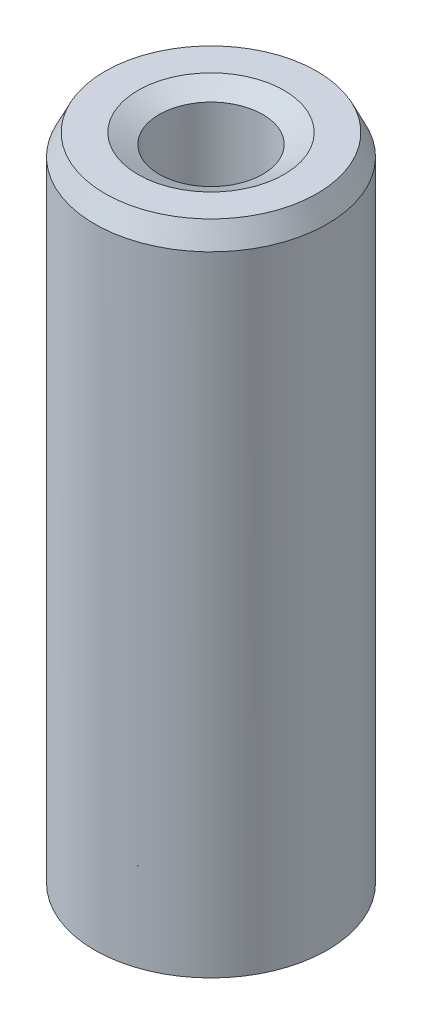
ISO-10303-21;
HEADER;
FILE_DESCRIPTION(('STEP AP214'),'2;1');
FILE_NAME('part.step','',(''),(''),'','','');
FILE_SCHEMA(('AUTOMOTIVE_DESIGN { 1 0 10303 214 1 1 1 1 }'));
ENDSEC;
DATA;
#1=APPLICATION_CONTEXT('core data for automotive mechanical design processes');
#2=APPLICATION_PROTOCOL_DEFINITION('international standard','automotive_design',2000,#1);
#3=PRODUCT_CONTEXT('',#1,'mechanical');
#4=PRODUCT('Part','Part','',(#3));
#5=PRODUCT_RELATED_PRODUCT_CATEGORY('part','',(#4));
#6=PRODUCT_DEFINITION_FORMATION('','',#4);
#7=PRODUCT_DEFINITION_CONTEXT('part definition',#1,'design');
#8=PRODUCT_DEFINITION('design','',#6,#7);
#9=PRODUCT_DEFINITION_SHAPE('','',#8);
#10=(LENGTH_UNIT() NAMED_UNIT(*) SI_UNIT(.MILLI.,.METRE.));
#11=(NAMED_UNIT(*) PLANE_ANGLE_UNIT() SI_UNIT($,.RADIAN.));
#12=(NAMED_UNIT(*) SI_UNIT($,.STERADIAN.) SOLID_ANGLE_UNIT());
#13=UNCERTAINTY_MEASURE_WITH_UNIT(LENGTH_MEASURE(1.E-05),#10,'distance_accuracy_value','');
#14=(GEOMETRIC_REPRESENTATION_CONTEXT(3) GLOBAL_UNCERTAINTY_ASSIGNED_CONTEXT((#13)) GLOBAL_UNIT_ASSIGNED_CONTEXT((#10,
#11,#12)) REPRESENTATION_CONTEXT('',''));
#15=CARTESIAN_POINT('',(0.,0.,0.));
#16=DIRECTION('',(0.,0.,1.));
#17=DIRECTION('',(1.,0.,0.));
#18=AXIS2_PLACEMENT_3D('',#15,#16,#17);
#19=CARTESIAN_POINT('',(0.,28.382326129375,0.));
#20=DIRECTION('',(0.,-1.,0.));
#21=DIRECTION('',(0.,0.,-1.));
#22=AXIS2_PLACEMENT_3D('',#19,#20,#21);
#23=CYLINDRICAL_SURFACE('',#22,5.);
#24=CARTESIAN_POINT('',(0.,0.444401364378996,0.));
#25=DIRECTION('',(0.,1.,0.));
#26=DIRECTION('',(0.,0.,1.));
#27=AXIS2_PLACEMENT_3D('',#24,#25,#26);
#28=CIRCLE('',#27,5.);
#29=CARTESIAN_POINT('',(0.,0.444401364378996,5.));
#30=VERTEX_POINT('',#29);
#31=EDGE_CURVE('E10',#30,#30,#28,.T.);
#32=ORIENTED_EDGE('',*,*,#31,.T.);
#33=EDGE_LOOP('',(#32));
#34=FACE_BOUND('',#33,.T.);
#35=CARTESIAN_POINT('',(0.,27.4717392956713,0.));
#36=DIRECTION('',(0.,1.,0.));
#37=DIRECTION('',(0.,0.,1.));
#38=AXIS2_PLACEMENT_3D('',#35,#36,#37);
#39=CIRCLE('',#38,5.);
#40=CARTESIAN_POINT('',(0.,27.4717392956713,-5.));
#41=VERTEX_POINT('',#40);
#42=EDGE_CURVE('E50',#41,#41,#39,.F.);
#43=ORIENTED_EDGE('',*,*,#42,.T.);
#44=EDGE_LOOP('',(#43));
#45=FACE_BOUND('',#44,.T.);
#46=ADVANCED_FACE('F39',(#34,#45),#23,.T.);
#47=CARTESIAN_POINT('',(0.,28.382326129375,0.));
#48=DIRECTION('',(0.,1.,0.));
#49=DIRECTION('',(0.,0.,1.));
#50=AXIS2_PLACEMENT_3D('',#47,#48,#49);
#51=PLANE('',#50);
#52=CARTESIAN_POINT('',(0.,28.382326129375,0.));
#53=DIRECTION('',(0.,1.,0.));
#54=DIRECTION('',(0.,0.,1.));
#55=AXIS2_PLACEMENT_3D('',#52,#53,#54);
#56=CIRCLE('',#55,3.1370231463045);
#57=CARTESIAN_POINT('',(0.,28.382326129375,3.1370231463045));
#58=VERTEX_POINT('',#57);
#59=EDGE_CURVE('E58',#58,#58,#56,.F.);
#60=ORIENTED_EDGE('',*,*,#59,.T.);
#61=EDGE_LOOP('',(#60));
#62=FACE_BOUND('',#61,.T.);
#63=CARTESIAN_POINT('',(0.,28.382326129375,0.));
#64=DIRECTION('',(0.,1.,0.));
#65=DIRECTION('',(0.,0.,1.));
#66=AXIS2_PLACEMENT_3D('',#63,#64,#65);
#67=CIRCLE('',#66,4.555598635621);
#68=CARTESIAN_POINT('',(0.,28.382326129375,-4.555598635621));
#69=VERTEX_POINT('',#68);
#70=EDGE_CURVE('E61',#69,#69,#67,.T.);
#71=ORIENTED_EDGE('',*,*,#70,.T.);
#72=EDGE_LOOP('',(#71));
#73=FACE_BOUND('',#72,.T.);
#74=ADVANCED_FACE('F88',(#62,#73),#51,.T.);
#75=CARTESIAN_POINT('',(0.,0.,0.));
#76=DIRECTION('',(0.,1.,0.));
#77=DIRECTION('',(0.,0.,1.));
#78=AXIS2_PLACEMENT_3D('',#75,#76,#77);
#79=PLANE('',#78);
#80=CARTESIAN_POINT('',(0.,0.,0.));
#81=DIRECTION('',(0.,1.,0.));
#82=DIRECTION('',(0.,0.,1.));
#83=AXIS2_PLACEMENT_3D('',#80,#81,#82);
#84=CIRCLE('',#83,2.67083767697979);
#85=CARTESIAN_POINT('',(0.,0.,-2.67083767697979));
#86=VERTEX_POINT('',#85);
#87=EDGE_CURVE('E51',#86,#86,#84,.T.);
#88=ORIENTED_EDGE('',*,*,#87,.T.);
#89=EDGE_LOOP('',(#88));
#90=FACE_BOUND('',#89,.T.);
#91=CARTESIAN_POINT('',(0.,0.,0.));
#92=DIRECTION('',(0.,1.,0.));
#93=DIRECTION('',(0.,0.,1.));
#94=AXIS2_PLACEMENT_3D('',#91,#92,#93);
#95=CIRCLE('',#94,4.08941316629629);
#96=CARTESIAN_POINT('',(0.,0.,4.08941316629629));
#97=VERTEX_POINT('',#96);
#98=EDGE_CURVE('E54',#97,#97,#95,.F.);
#99=ORIENTED_EDGE('',*,*,#98,.T.);
#100=EDGE_LOOP('',(#99));
#101=FACE_BOUND('',#100,.T.);
#102=ADVANCED_FACE('F83',(#90,#101),#79,.F.);
#103=CARTESIAN_POINT('',(0.,28.382326129375,0.));
#104=DIRECTION('',(0.,-1.,0.));
#105=DIRECTION('',(0.,0.,-1.));
#106=AXIS2_PLACEMENT_3D('',#103,#104,#105);
#107=CYLINDRICAL_SURFACE('',#106,2.2264363126008);
#108=CARTESIAN_POINT('',(0.,27.937924764996,0.));
#109=DIRECTION('',(0.,1.,0.));
#110=DIRECTION('',(0.,0.,1.));
#111=AXIS2_PLACEMENT_3D('',#108,#109,#110);
#112=CIRCLE('',#111,2.2264363126008);
#113=CARTESIAN_POINT('',(0.,27.937924764996,2.2264363126008));
#114=VERTEX_POINT('',#113);
#115=EDGE_CURVE('E67',#114,#114,#112,.T.);
#116=ORIENTED_EDGE('',*,*,#115,.T.);
#117=EDGE_LOOP('',(#116));
#118=FACE_BOUND('',#117,.T.);
#119=CARTESIAN_POINT('',(0.,0.910586833703701,0.));
#120=DIRECTION('',(0.,1.,0.));
#121=DIRECTION('',(0.,0.,1.));
#122=AXIS2_PLACEMENT_3D('',#119,#120,#121);
#123=CIRCLE('',#122,2.2264363126008);
#124=CARTESIAN_POINT('',(0.,0.910586833703701,-2.2264363126008));
#125=VERTEX_POINT('',#124);
#126=EDGE_CURVE('E69',#125,#125,#123,.F.);
#127=ORIENTED_EDGE('',*,*,#126,.T.);
#128=EDGE_LOOP('',(#127));
#129=FACE_BOUND('',#128,.T.);
#130=ADVANCED_FACE('F71',(#118,#129),#107,.F.);
#131=CARTESIAN_POINT('',(0.,27.937924764996,0.));
#132=DIRECTION('',(0.,1.,0.));
#133=DIRECTION('',(0.,0.,1.));
#134=AXIS2_PLACEMENT_3D('',#131,#132,#133);
#135=CONICAL_SURFACE('',#134,2.2264363126008,1.11676368677092);
#136=ORIENTED_EDGE('',*,*,#59,.F.);
#137=EDGE_LOOP('',(#136));
#138=FACE_BOUND('',#137,.T.);
#139=ORIENTED_EDGE('',*,*,#115,.F.);
#140=EDGE_LOOP('',(#139));
#141=FACE_BOUND('',#140,.T.);
#142=ADVANCED_FACE('F77',(#138,#141),#135,.F.);
#143=CARTESIAN_POINT('',(0.,0.,0.));
#144=DIRECTION('',(0.,-1.,0.));
#145=DIRECTION('',(0.,0.,-1.));
#146=AXIS2_PLACEMENT_3D('',#143,#144,#145);
#147=CONICAL_SURFACE('',#146,2.67083767697979,0.454032640023979);
#148=CARTESIAN_POINT('',(0.,0.910586833703701,-2.2264363126008));
#149=CARTESIAN_POINT('',(0.,0.901101554185954,-2.23106549347975));
#150=CARTESIAN_POINT('',(0.,0.891616274668207,-2.2356946743587));
#151=CARTESIAN_POINT('',(0.,0.872645715632714,-2.24495303611659));
#152=CARTESIAN_POINT('',(0.,0.863160436114967,-2.24958221699554));
#153=CARTESIAN_POINT('',(0.,0.844189877079473,-2.25884057875344));
#154=CARTESIAN_POINT('',(0.,0.834704597561726,-2.26346975963238));
#155=CARTESIAN_POINT('',(0.,0.815734038526232,-2.27272812139028));
#156=CARTESIAN_POINT('',(0.,0.806248759008485,-2.27735730226923));
#157=CARTESIAN_POINT('',(0.,0.787278199972992,-2.28661566402712));
#158=CARTESIAN_POINT('',(0.,0.777792920455245,-2.29124484490607));
#159=CARTESIAN_POINT('',(0.,0.758822361419751,-2.30050320666397));
#160=CARTESIAN_POINT('',(0.,0.749337081902004,-2.30513238754292));
#161=CARTESIAN_POINT('',(0.,0.73036652286651,-2.31439074930081));
#162=CARTESIAN_POINT('',(0.,0.720881243348763,-2.31901993017976));
#163=CARTESIAN_POINT('',(0.,0.70191068431327,-2.32827829193765));
#164=CARTESIAN_POINT('',(0.,0.692425404795523,-2.3329074728166));
#165=CARTESIAN_POINT('',(0.,0.673454845760029,-2.3421658345745));
#166=CARTESIAN_POINT('',(0.,0.663969566242282,-2.34679501545345));
#167=CARTESIAN_POINT('',(0.,0.644999007206788,-2.35605337721134));
#168=CARTESIAN_POINT('',(0.,0.635513727689041,-2.36068255809029));
#169=CARTESIAN_POINT('',(0.,0.616543168653548,-2.36994091984818));
#170=CARTESIAN_POINT('',(0.,0.607057889135801,-2.37457010072713));
#171=CARTESIAN_POINT('',(0.,0.588087330100307,-2.38382846248503));
#172=CARTESIAN_POINT('',(0.,0.57860205058256,-2.38845764336398));
#173=CARTESIAN_POINT('',(0.,0.559631491547066,-2.39771600512187));
#174=CARTESIAN_POINT('',(0.,0.550146212029319,-2.40234518600082));
#175=CARTESIAN_POINT('',(0.,0.531175652993826,-2.41160354775872));
#176=CARTESIAN_POINT('',(0.,0.521690373476079,-2.41623272863766));
#177=CARTESIAN_POINT('',(0.,0.502719814440585,-2.42549109039556));
#178=CARTESIAN_POINT('',(0.,0.493234534922838,-2.43012027127451));
#179=CARTESIAN_POINT('',(0.,0.474263975887344,-2.4393786330324));
#180=CARTESIAN_POINT('',(0.,0.464778696369598,-2.44400781391135));
#181=CARTESIAN_POINT('',(0.,0.445808137334104,-2.45326617566925));
#182=CARTESIAN_POINT('',(0.,0.436322857816357,-2.45789535654819));
#183=CARTESIAN_POINT('',(0.,0.417352298780863,-2.46715371830609));
#184=CARTESIAN_POINT('',(0.,0.407867019263116,-2.47178289918504));
#185=CARTESIAN_POINT('',(0.,0.388896460227622,-2.48104126094293));
#186=CARTESIAN_POINT('',(0.,0.379411180709875,-2.48567044182188));
#187=CARTESIAN_POINT('',(0.,0.360440621674382,-2.49492880357978));
#188=CARTESIAN_POINT('',(0.,0.350955342156635,-2.49955798445872));
#189=CARTESIAN_POINT('',(0.,0.331984783121141,-2.50881634621662));
#190=CARTESIAN_POINT('',(0.,0.322499503603394,-2.51344552709557));
#191=CARTESIAN_POINT('',(0.,0.3035289445679,-2.52270388885346));
#192=CARTESIAN_POINT('',(0.,0.294043665050153,-2.52733306973241));
#193=CARTESIAN_POINT('',(0.,0.27507310601466,-2.53659143149031));
#194=CARTESIAN_POINT('',(0.,0.265587826496913,-2.54122061236925));
#195=CARTESIAN_POINT('',(0.,0.246617267461419,-2.55047897412715));
#196=CARTESIAN_POINT('',(0.,0.237131987943672,-2.5551081550061));
#197=CARTESIAN_POINT('',(0.,0.218161428908178,-2.56436651676399));
#198=CARTESIAN_POINT('',(0.,0.208676149390431,-2.56899569764294));
#199=CARTESIAN_POINT('',(0.,0.189705590354938,-2.57825405940084));
#200=CARTESIAN_POINT('',(0.,0.180220310837191,-2.58288324027979));
#201=CARTESIAN_POINT('',(0.,0.161249751801697,-2.59214160203768));
#202=CARTESIAN_POINT('',(0.,0.15176447228395,-2.59677078291663));
#203=CARTESIAN_POINT('',(0.,0.132793913248456,-2.60602914467452));
#204=CARTESIAN_POINT('',(0.,0.12330863373071,-2.61065832555347));
#205=CARTESIAN_POINT('',(0.,0.104338074695216,-2.61991668731137));
#206=CARTESIAN_POINT('',(0.,0.0948527951774688,-2.62454586819032));
#207=CARTESIAN_POINT('',(0.,0.0758822361419751,-2.63380422994821));
#208=CARTESIAN_POINT('',(0.,0.0663969566242282,-2.63843341082716));
#209=CARTESIAN_POINT('',(0.,0.0474263975887345,-2.64769177258505));
#210=CARTESIAN_POINT('',(0.,0.0379411180709875,-2.652320953464));
#211=CARTESIAN_POINT('',(0.,0.0189705590354937,-2.6615793152219));
#212=CARTESIAN_POINT('',(0.,0.0094852795177468,-2.66620849610085));
#213=CARTESIAN_POINT('',(0.,0.,-2.67083767697979));
#214=B_SPLINE_CURVE_WITH_KNOTS('',3,(#148,#149,#150,#151,#152,#153,#154,#155,#156,#157,#158,
#159,#160,#161,#162,#163,#164,#165,#166,#167,#168,#169,#170,#171,#172,#173,#174,#175,#176,#177,
#178,#179,#180,#181,#182,#183,#184,#185,#186,#187,#188,#189,#190,#191,#192,#193,#194,#195,#196,
#197,#198,#199,#200,#201,#202,#203,#204,#205,#206,#207,#208,#209,#210,#211,#212,#213),
.UNSPECIFIED.,.F.,.F.,(4,2,2,2,2,2,2,2,2,2,2,2,2,2,2,2,2,2,2,2,2,2,2,2,2,2,2,2,2,2,2,2,4),(0.,
0.0316638372320578,0.0633276744641153,0.0949915116961731,0.126655348928231,0.158319186160288,
0.189983023392346,0.221646860624404,0.253310697856462,0.284974535088519,0.316638372320577,
0.348302209552635,0.379966046784692,0.41162988401675,0.443293721248808,0.474957558480865,
0.506621395712923,0.538285232944981,0.569949070177039,0.601612907409096,0.633276744641154,
0.664940581873212,0.696604419105269,0.728268256337327,0.759932093569385,0.791595930801443,
0.8232597680335,0.854923605265558,0.886587442497616,0.918251279729673,0.949915116961731,
0.981578954193789,1.01324279142585),.UNSPECIFIED.);
#215=EDGE_CURVE('BSEAM73',#125,#86,#214,.T.);
#216=ORIENTED_EDGE('',*,*,#126,.F.);
#217=ORIENTED_EDGE('',*,*,#87,.F.);
#218=ORIENTED_EDGE('',*,*,#215,.T.);
#219=ORIENTED_EDGE('',*,*,#215,.F.);
#220=EDGE_LOOP('',(#216,#218,#217,#219));
#221=FACE_BOUND('',#220,.T.);
#222=ADVANCED_FACE('F73',(#221),#147,.F.);
#223=CARTESIAN_POINT('',(0.,0.444401364378996,0.));
#224=DIRECTION('',(0.,1.,0.));
#225=DIRECTION('',(0.,0.,1.));
#226=AXIS2_PLACEMENT_3D('',#223,#224,#225);
#227=CONICAL_SURFACE('',#226,5.,1.11676368677092);
#228=ORIENTED_EDGE('',*,*,#98,.F.);
#229=EDGE_LOOP('',(#228));
#230=FACE_BOUND('',#229,.T.);
#231=ORIENTED_EDGE('',*,*,#31,.F.);
#232=EDGE_LOOP('',(#231));
#233=FACE_BOUND('',#232,.T.);
#234=ADVANCED_FACE('F76',(#230,#233),#227,.T.);
#235=CARTESIAN_POINT('',(0.,28.382326129375,0.));
#236=DIRECTION('',(0.,-1.,0.));
#237=DIRECTION('',(0.,0.,-1.));
#238=AXIS2_PLACEMENT_3D('',#235,#236,#237);
#239=CONICAL_SURFACE('',#238,4.555598635621,0.454032640023981);
#240=CARTESIAN_POINT('',(0.,27.4717392956713,-5.));
#241=CARTESIAN_POINT('',(0.,27.481224575189,-4.99537081912105));
#242=CARTESIAN_POINT('',(0.,27.4907098547068,-4.99074163824211));
#243=CARTESIAN_POINT('',(0.,27.5096804137423,-4.98148327648421));
#244=CARTESIAN_POINT('',(0.,27.51916569326,-4.97685409560526));
#245=CARTESIAN_POINT('',(0.,27.5381362522955,-4.96759573384736));
#246=CARTESIAN_POINT('',(0.,27.5476215318133,-4.96296655296842));
#247=CARTESIAN_POINT('',(0.,27.5665920908487,-4.95370819121052));
#248=CARTESIAN_POINT('',(0.,27.5760773703665,-4.94907901033157));
#249=CARTESIAN_POINT('',(0.,27.595047929402,-4.93982064857368));
#250=CARTESIAN_POINT('',(0.,27.6045332089197,-4.93519146769473));
#251=CARTESIAN_POINT('',(0.,27.6235037679552,-4.92593310593683));
#252=CARTESIAN_POINT('',(0.,27.632989047473,-4.92130392505789));
#253=CARTESIAN_POINT('',(0.,27.6519596065085,-4.91204556329999));
#254=CARTESIAN_POINT('',(0.,27.6614448860262,-4.90741638242104));
#255=CARTESIAN_POINT('',(0.,27.6804154450617,-4.89815802066315));
#256=CARTESIAN_POINT('',(0.,27.6899007245795,-4.8935288397842));
#257=CARTESIAN_POINT('',(0.,27.708871283615,-4.8842704780263));
#258=CARTESIAN_POINT('',(0.,27.7183565631327,-4.87964129714735));
#259=CARTESIAN_POINT('',(0.,27.7373271221682,-4.87038293538946));
#260=CARTESIAN_POINT('',(0.,27.7468124016859,-4.86575375451051));
#261=CARTESIAN_POINT('',(0.,27.7657829607214,-4.85649539275262));
#262=CARTESIAN_POINT('',(0.,27.7752682402392,-4.85186621187367));
#263=CARTESIAN_POINT('',(0.,27.7942387992747,-4.84260785011577));
#264=CARTESIAN_POINT('',(0.,27.8037240787924,-4.83797866923682));
#265=CARTESIAN_POINT('',(0.,27.8226946378279,-4.82872030747893));
#266=CARTESIAN_POINT('',(0.,27.8321799173457,-4.82409112659998));
#267=CARTESIAN_POINT('',(0.,27.8511504763812,-4.81483276484208));
#268=CARTESIAN_POINT('',(0.,27.8606357558989,-4.81020358396314));
#269=CARTESIAN_POINT('',(0.,27.8796063149344,-4.80094522220524));
#270=CARTESIAN_POINT('',(0.,27.8890915944522,-4.79631604132629));
#271=CARTESIAN_POINT('',(0.,27.9080621534876,-4.7870576795684));
#272=CARTESIAN_POINT('',(0.,27.9175474330054,-4.78242849868945));
#273=CARTESIAN_POINT('',(0.,27.9365179920409,-4.77317013693155));
#274=CARTESIAN_POINT('',(0.,27.9460032715586,-4.7685409560526));
#275=CARTESIAN_POINT('',(0.,27.9649738305941,-4.75928259429471));
#276=CARTESIAN_POINT('',(0.,27.9744591101119,-4.75465341341576));
#277=CARTESIAN_POINT('',(0.,27.9934296691474,-4.74539505165786));
#278=CARTESIAN_POINT('',(0.,28.0029149486651,-4.74076587077892));
#279=CARTESIAN_POINT('',(0.,28.0218855077006,-4.73150750902102));
#280=CARTESIAN_POINT('',(0.,28.0313707872184,-4.72687832814207));
#281=CARTESIAN_POINT('',(0.,28.0503413462538,-4.71761996638418));
#282=CARTESIAN_POINT('',(0.,28.0598266257716,-4.71299078550523));
#283=CARTESIAN_POINT('',(0.,28.0787971848071,-4.70373242374733));
#284=CARTESIAN_POINT('',(0.,28.0882824643248,-4.69910324286838));
#285=CARTESIAN_POINT('',(0.,28.1072530233603,-4.68984488111049));
#286=CARTESIAN_POINT('',(0.,28.1167383028781,-4.68521570023154));
#287=CARTESIAN_POINT('',(0.,28.1357088619136,-4.67595733847365));
#288=CARTESIAN_POINT('',(0.,28.1451941414313,-4.6713281575947));
#289=CARTESIAN_POINT('',(0.,28.1641647004668,-4.6620697958368));
#290=CARTESIAN_POINT('',(0.,28.1736499799846,-4.65744061495785));
#291=CARTESIAN_POINT('',(0.,28.1926205390201,-4.64818225319996));
#292=CARTESIAN_POINT('',(0.,28.2021058185378,-4.64355307232101));
#293=CARTESIAN_POINT('',(0.,28.2210763775733,-4.63429471056311));
#294=CARTESIAN_POINT('',(0.,28.230561657091,-4.62966552968417));
#295=CARTESIAN_POINT('',(0.,28.2495322161265,-4.62040716792627));
#296=CARTESIAN_POINT('',(0.,28.2590174956443,-4.61577798704732));
#297=CARTESIAN_POINT('',(0.,28.2779880546798,-4.60651962528943));
#298=CARTESIAN_POINT('',(0.,28.2874733341975,-4.60189044441048));
#299=CARTESIAN_POINT('',(0.,28.306443893233,-4.59263208265258));
#300=CARTESIAN_POINT('',(0.,28.3159291727508,-4.58800290177363));
#301=CARTESIAN_POINT('',(0.,28.3348997317863,-4.57874454001574));
#302=CARTESIAN_POINT('',(0.,28.344385011304,-4.57411535913679));
#303=CARTESIAN_POINT('',(0.,28.3633555703395,-4.56485699737889));
#304=CARTESIAN_POINT('',(0.,28.3728408498572,-4.56022781649995));
#305=CARTESIAN_POINT('',(0.,28.382326129375,-4.555598635621));
#306=B_SPLINE_CURVE_WITH_KNOTS('',3,(#240,#241,#242,#243,#244,#245,#246,#247,#248,#249,#250,
#251,#252,#253,#254,#255,#256,#257,#258,#259,#260,#261,#262,#263,#264,#265,#266,#267,#268,#269,
#270,#271,#272,#273,#274,#275,#276,#277,#278,#279,#280,#281,#282,#283,#284,#285,#286,#287,#288,
#289,#290,#291,#292,#293,#294,#295,#296,#297,#298,#299,#300,#301,#302,#303,#304,#305),
.UNSPECIFIED.,.F.,.F.,(4,2,2,2,2,2,2,2,2,2,2,2,2,2,2,2,2,2,2,2,2,2,2,2,2,2,2,2,2,2,2,2,4),(0.,
0.0316638372320582,0.0633276744641163,0.0949915116961741,0.126655348928232,0.15831918616029,
0.189983023392348,0.221646860624406,0.253310697856464,0.284974535088523,0.31663837232058,
0.348302209552642,0.3799660467847,0.411629884016758,0.443293721248816,0.474957558480874,
0.506621395712932,0.53828523294499,0.569949070177048,0.601612907409106,0.633276744641164,
0.664940581873222,0.696604419105283,0.728268256337341,0.759932093569399,0.791595930801457,
0.823259768033515,0.854923605265573,0.886587442497631,0.918251279729689,0.949915116961747,
0.981578954193805,1.01324279142587),.UNSPECIFIED.);
#307=EDGE_CURVE('BSEAM45',#41,#69,#306,.T.);
#308=ORIENTED_EDGE('',*,*,#42,.F.);
#309=ORIENTED_EDGE('',*,*,#70,.F.);
#310=ORIENTED_EDGE('',*,*,#307,.T.);
#311=ORIENTED_EDGE('',*,*,#307,.F.);
#312=EDGE_LOOP('',(#308,#310,#309,#311));
#313=FACE_BOUND('',#312,.T.);
#314=ADVANCED_FACE('F45',(#313),#239,.T.);
#315=CLOSED_SHELL('',(#46,#74,#102,#130,#142,#222,#234,#314));
#316=MANIFOLD_SOLID_BREP('B2',#315);
#317=ADVANCED_BREP_SHAPE_REPRESENTATION('',(#18,#316),#14);
#318=SHAPE_DEFINITION_REPRESENTATION(#9,#317);
ENDSEC;
END-ISO-10303-21;
